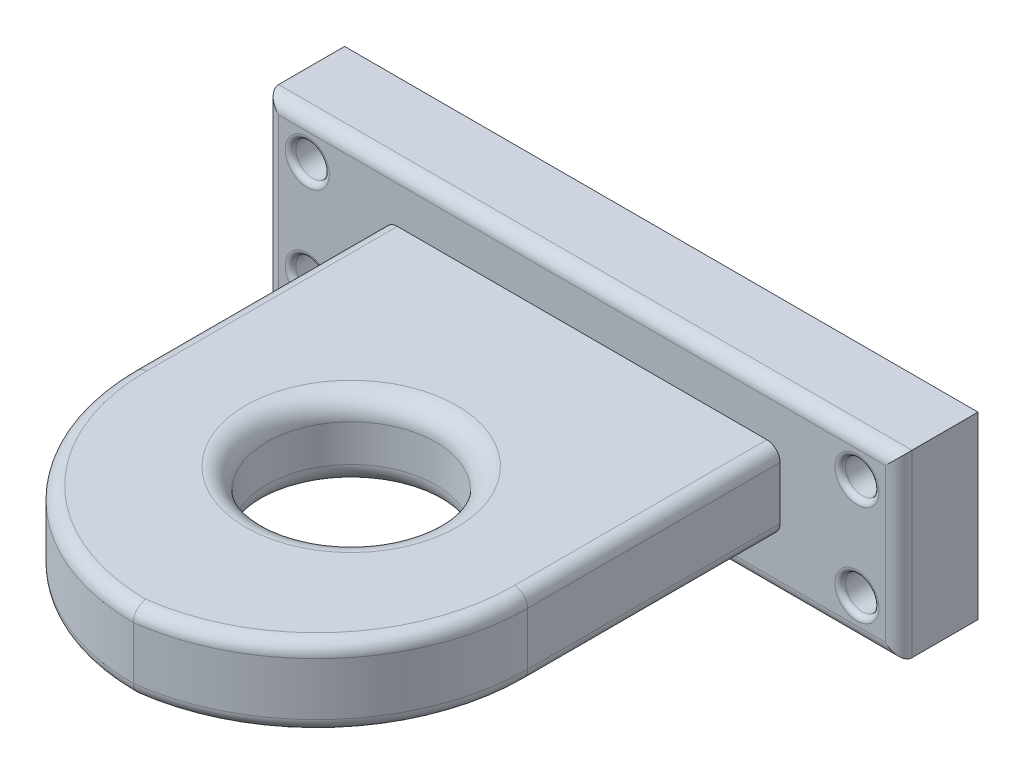
ISO-10303-21;
HEADER;
FILE_DESCRIPTION(('STEP AP214'),'2;1');
FILE_NAME('part.step','',(''),(''),'','','');
FILE_SCHEMA(('AUTOMOTIVE_DESIGN { 1 0 10303 214 1 1 1 1 }'));
ENDSEC;
DATA;
#1=APPLICATION_CONTEXT('core data for automotive mechanical design processes');
#2=APPLICATION_PROTOCOL_DEFINITION('international standard','automotive_design',2000,#1);
#3=PRODUCT_CONTEXT('',#1,'mechanical');
#4=PRODUCT('Part','Part','',(#3));
#5=PRODUCT_RELATED_PRODUCT_CATEGORY('part','',(#4));
#6=PRODUCT_DEFINITION_FORMATION('','',#4);
#7=PRODUCT_DEFINITION_CONTEXT('part definition',#1,'design');
#8=PRODUCT_DEFINITION('design','',#6,#7);
#9=PRODUCT_DEFINITION_SHAPE('','',#8);
#10=(LENGTH_UNIT() NAMED_UNIT(*) SI_UNIT(.MILLI.,.METRE.));
#11=(NAMED_UNIT(*) PLANE_ANGLE_UNIT() SI_UNIT($,.RADIAN.));
#12=(NAMED_UNIT(*) SI_UNIT($,.STERADIAN.) SOLID_ANGLE_UNIT());
#13=UNCERTAINTY_MEASURE_WITH_UNIT(LENGTH_MEASURE(1.E-05),#10,'distance_accuracy_value','');
#14=(GEOMETRIC_REPRESENTATION_CONTEXT(3) GLOBAL_UNCERTAINTY_ASSIGNED_CONTEXT((#13)) GLOBAL_UNIT_ASSIGNED_CONTEXT((#10,
#11,#12)) REPRESENTATION_CONTEXT('',''));
#15=CARTESIAN_POINT('',(0.,0.,0.));
#16=DIRECTION('',(0.,0.,1.));
#17=DIRECTION('',(1.,0.,0.));
#18=AXIS2_PLACEMENT_3D('',#15,#16,#17);
#19=CARTESIAN_POINT('',(0.,30.,0.));
#20=DIRECTION('',(1.,0.,0.));
#21=DIRECTION('',(0.,0.,-1.));
#22=AXIS2_PLACEMENT_3D('',#19,#20,#21);
#23=PLANE('',#22);
#24=DIRECTION('',(0.,-1.,0.));
#25=VECTOR('',#24,1.);
#26=CARTESIAN_POINT('',(0.,30.,0.));
#27=LINE('',#26,#25);
#28=CARTESIAN_POINT('',(0.,25.,0.));
#29=VERTEX_POINT('',#28);
#30=CARTESIAN_POINT('',(0.,5.,0.));
#31=VERTEX_POINT('',#30);
#32=EDGE_CURVE('E197',#29,#31,#27,.T.);
#33=ORIENTED_EDGE('',*,*,#32,.T.);
#34=DIRECTION('',(0.,0.,1.));
#35=VECTOR('',#34,1.);
#36=CARTESIAN_POINT('',(0.,5.,0.));
#37=LINE('',#36,#35);
#38=CARTESIAN_POINT('',(0.,5.,95.));
#39=VERTEX_POINT('',#38);
#40=EDGE_CURVE('E294',#31,#39,#37,.T.);
#41=ORIENTED_EDGE('',*,*,#40,.T.);
#42=DIRECTION('',(0.,-1.,0.));
#43=VECTOR('',#42,1.);
#44=CARTESIAN_POINT('',(0.,30.,95.));
#45=LINE('',#44,#43);
#46=CARTESIAN_POINT('',(0.,25.,95.));
#47=VERTEX_POINT('',#46);
#48=EDGE_CURVE('E210',#39,#47,#45,.F.);
#49=ORIENTED_EDGE('',*,*,#48,.T.);
#50=DIRECTION('',(0.,0.,1.));
#51=VECTOR('',#50,1.);
#52=CARTESIAN_POINT('',(0.,25.,0.));
#53=LINE('',#52,#51);
#54=EDGE_CURVE('E291',#47,#29,#53,.F.);
#55=ORIENTED_EDGE('',*,*,#54,.T.);
#56=EDGE_LOOP('',(#33,#41,#49,#55));
#57=FACE_BOUND('',#56,.T.);
#58=ADVANCED_FACE('F39',(#57),#23,.F.);
#59=CARTESIAN_POINT('',(150.,30.,0.));
#60=DIRECTION('',(-1.,0.,0.));
#61=DIRECTION('',(0.,0.,1.));
#62=AXIS2_PLACEMENT_3D('',#59,#60,#61);
#63=PLANE('',#62);
#64=DIRECTION('',(0.,-1.,0.));
#65=VECTOR('',#64,1.);
#66=CARTESIAN_POINT('',(150.,30.,95.6274606680623));
#67=LINE('',#66,#65);
#68=CARTESIAN_POINT('',(150.,25.,95.6274606680623));
#69=VERTEX_POINT('',#68);
#70=CARTESIAN_POINT('',(150.,5.,95.6274606680623));
#71=VERTEX_POINT('',#70);
#72=EDGE_CURVE('E214',#69,#71,#67,.T.);
#73=ORIENTED_EDGE('',*,*,#72,.T.);
#74=DIRECTION('',(0.,0.,-1.));
#75=VECTOR('',#74,1.);
#76=CARTESIAN_POINT('',(150.,5.,0.));
#77=LINE('',#76,#75);
#78=CARTESIAN_POINT('',(150.,5.,0.));
#79=VERTEX_POINT('',#78);
#80=EDGE_CURVE('E275',#71,#79,#77,.T.);
#81=ORIENTED_EDGE('',*,*,#80,.T.);
#82=DIRECTION('',(0.,-1.,0.));
#83=VECTOR('',#82,1.);
#84=CARTESIAN_POINT('',(150.,30.,0.));
#85=LINE('',#84,#83);
#86=CARTESIAN_POINT('',(150.,25.,0.));
#87=VERTEX_POINT('',#86);
#88=EDGE_CURVE('E202',#87,#79,#85,.T.);
#89=ORIENTED_EDGE('',*,*,#88,.F.);
#90=DIRECTION('',(0.,0.,-1.));
#91=VECTOR('',#90,1.);
#92=CARTESIAN_POINT('',(150.,25.,95.6274606680623));
#93=LINE('',#92,#91);
#94=EDGE_CURVE('E258',#87,#69,#93,.F.);
#95=ORIENTED_EDGE('',*,*,#94,.T.);
#96=EDGE_LOOP('',(#73,#81,#89,#95));
#97=FACE_BOUND('',#96,.T.);
#98=ADVANCED_FACE('F429',(#97),#63,.F.);
#99=CARTESIAN_POINT('',(0.,30.,0.));
#100=DIRECTION('',(0.,1.,0.));
#101=DIRECTION('',(0.,0.,1.));
#102=AXIS2_PLACEMENT_3D('',#99,#100,#101);
#103=PLANE('',#102);
#104=DIRECTION('',(-1.,0.,0.));
#105=VECTOR('',#104,1.);
#106=CARTESIAN_POINT('',(0.,30.,0.));
#107=LINE('',#106,#105);
#108=CARTESIAN_POINT('',(145.,30.,0.));
#109=VERTEX_POINT('',#108);
#110=CARTESIAN_POINT('',(5.,30.,0.));
#111=VERTEX_POINT('',#110);
#112=EDGE_CURVE('E189',#109,#111,#107,.T.);
#113=ORIENTED_EDGE('',*,*,#112,.T.);
#114=DIRECTION('',(0.,0.,1.));
#115=VECTOR('',#114,1.);
#116=CARTESIAN_POINT('',(5.00000000000001,30.,95.));
#117=LINE('',#116,#115);
#118=CARTESIAN_POINT('',(5.00000000000001,30.,95.));
#119=VERTEX_POINT('',#118);
#120=EDGE_CURVE('E317',#111,#119,#117,.T.);
#121=ORIENTED_EDGE('',*,*,#120,.T.);
#122=CARTESIAN_POINT('',(80.,30.,95.));
#123=DIRECTION('',(0.,1.,0.));
#124=DIRECTION('',(0.,0.,1.));
#125=AXIS2_PLACEMENT_3D('',#122,#123,#124);
#126=CIRCLE('',#125,75.);
#127=CARTESIAN_POINT('',(79.6862284823804,30.,169.999343646693));
#128=VERTEX_POINT('',#127);
#129=EDGE_CURVE('E311',#119,#128,#126,.T.);
#130=ORIENTED_EDGE('',*,*,#129,.T.);
#131=CARTESIAN_POINT('',(70.,30.,95.6274606680623));
#132=DIRECTION('',(0.,1.,0.));
#133=DIRECTION('',(0.,0.,1.));
#134=AXIS2_PLACEMENT_3D('',#131,#132,#133);
#135=CIRCLE('',#134,75.);
#136=CARTESIAN_POINT('',(145.,30.,95.6274606680623));
#137=VERTEX_POINT('',#136);
#138=EDGE_CURVE('E63',#128,#137,#135,.T.);
#139=ORIENTED_EDGE('',*,*,#138,.T.);
#140=DIRECTION('',(0.,0.,-1.));
#141=VECTOR('',#140,1.);
#142=CARTESIAN_POINT('',(145.,30.,0.));
#143=LINE('',#142,#141);
#144=EDGE_CURVE('E314',#137,#109,#143,.T.);
#145=ORIENTED_EDGE('',*,*,#144,.T.);
#146=EDGE_LOOP('',(#113,#121,#130,#139,#145));
#147=FACE_BOUND('',#146,.T.);
#148=CARTESIAN_POINT('',(75.,30.,87.5));
#149=DIRECTION('',(0.,1.,0.));
#150=DIRECTION('',(0.,0.,1.));
#151=AXIS2_PLACEMENT_3D('',#148,#149,#150);
#152=CIRCLE('',#151,40.);
#153=CARTESIAN_POINT('',(75.,30.,127.5));
#154=VERTEX_POINT('',#153);
#155=EDGE_CURVE('E222',#154,#154,#152,.F.);
#156=ORIENTED_EDGE('',*,*,#155,.T.);
#157=EDGE_LOOP('',(#156));
#158=FACE_BOUND('',#157,.T.);
#159=ADVANCED_FACE('F435',(#147,#158),#103,.T.);
#160=CARTESIAN_POINT('',(0.,0.,0.));
#161=DIRECTION('',(0.,1.,0.));
#162=DIRECTION('',(0.,0.,1.));
#163=AXIS2_PLACEMENT_3D('',#160,#161,#162);
#164=PLANE('',#163);
#165=DIRECTION('',(-1.,0.,0.));
#166=VECTOR('',#165,1.);
#167=CARTESIAN_POINT('',(0.,0.,0.));
#168=LINE('',#167,#166);
#169=CARTESIAN_POINT('',(145.,0.,0.));
#170=VERTEX_POINT('',#169);
#171=CARTESIAN_POINT('',(5.,0.,0.));
#172=VERTEX_POINT('',#171);
#173=EDGE_CURVE('E184',#170,#172,#168,.T.);
#174=ORIENTED_EDGE('',*,*,#173,.F.);
#175=DIRECTION('',(0.,0.,-1.));
#176=VECTOR('',#175,1.);
#177=CARTESIAN_POINT('',(145.,0.,0.));
#178=LINE('',#177,#176);
#179=CARTESIAN_POINT('',(145.,0.,95.6274606680623));
#180=VERTEX_POINT('',#179);
#181=EDGE_CURVE('E288',#170,#180,#178,.F.);
#182=ORIENTED_EDGE('',*,*,#181,.T.);
#183=CARTESIAN_POINT('',(70.,0.,95.6274606680623));
#184=DIRECTION('',(0.,1.,0.));
#185=DIRECTION('',(0.,0.,1.));
#186=AXIS2_PLACEMENT_3D('',#183,#184,#185);
#187=CIRCLE('',#186,75.);
#188=CARTESIAN_POINT('',(79.6862284823804,0.,169.999343646693));
#189=VERTEX_POINT('',#188);
#190=EDGE_CURVE('E279',#180,#189,#187,.F.);
#191=ORIENTED_EDGE('',*,*,#190,.T.);
#192=CARTESIAN_POINT('',(80.,0.,95.));
#193=DIRECTION('',(0.,1.,0.));
#194=DIRECTION('',(0.,0.,1.));
#195=AXIS2_PLACEMENT_3D('',#192,#193,#194);
#196=CIRCLE('',#195,75.);
#197=CARTESIAN_POINT('',(5.00000000000001,0.,95.));
#198=VERTEX_POINT('',#197);
#199=EDGE_CURVE('E282',#189,#198,#196,.F.);
#200=ORIENTED_EDGE('',*,*,#199,.T.);
#201=DIRECTION('',(0.,0.,1.));
#202=VECTOR('',#201,1.);
#203=CARTESIAN_POINT('',(5.,0.,0.));
#204=LINE('',#203,#202);
#205=EDGE_CURVE('E285',#198,#172,#204,.F.);
#206=ORIENTED_EDGE('',*,*,#205,.T.);
#207=EDGE_LOOP('',(#174,#182,#191,#200,#206));
#208=FACE_BOUND('',#207,.T.);
#209=CARTESIAN_POINT('',(75.,0.,87.5));
#210=DIRECTION('',(0.,1.,0.));
#211=DIRECTION('',(0.,0.,1.));
#212=AXIS2_PLACEMENT_3D('',#209,#210,#211);
#213=CIRCLE('',#212,40.);
#214=CARTESIAN_POINT('',(75.,0.,127.5));
#215=VERTEX_POINT('',#214);
#216=EDGE_CURVE('E226',#215,#215,#213,.T.);
#217=ORIENTED_EDGE('',*,*,#216,.T.);
#218=EDGE_LOOP('',(#217));
#219=FACE_BOUND('',#218,.T.);
#220=ADVANCED_FACE('F491',(#208,#219),#164,.F.);
#221=CARTESIAN_POINT('',(75.,0.,87.5));
#222=DIRECTION('',(0.,1.,0.));
#223=DIRECTION('',(0.,0.,1.));
#224=AXIS2_PLACEMENT_3D('',#221,#222,#223);
#225=CYLINDRICAL_SURFACE('',#224,32.);
#226=CARTESIAN_POINT('',(75.,8.,87.5));
#227=DIRECTION('',(0.,1.,0.));
#228=DIRECTION('',(0.,0.,1.));
#229=AXIS2_PLACEMENT_3D('',#226,#227,#228);
#230=CIRCLE('',#229,32.);
#231=CARTESIAN_POINT('',(75.,8.,119.5));
#232=VERTEX_POINT('',#231);
#233=EDGE_CURVE('E230',#232,#232,#230,.F.);
#234=ORIENTED_EDGE('',*,*,#233,.T.);
#235=EDGE_LOOP('',(#234));
#236=FACE_BOUND('',#235,.T.);
#237=CARTESIAN_POINT('',(75.,22.,87.5));
#238=DIRECTION('',(0.,1.,0.));
#239=DIRECTION('',(0.,0.,1.));
#240=AXIS2_PLACEMENT_3D('',#237,#238,#239);
#241=CIRCLE('',#240,32.);
#242=CARTESIAN_POINT('',(75.,22.,119.5));
#243=VERTEX_POINT('',#242);
#244=EDGE_CURVE('E218',#243,#243,#241,.T.);
#245=ORIENTED_EDGE('',*,*,#244,.T.);
#246=EDGE_LOOP('',(#245));
#247=FACE_BOUND('',#246,.T.);
#248=ADVANCED_FACE('F444',(#236,#247),#225,.F.);
#249=CARTESIAN_POINT('',(80.,30.,95.));
#250=DIRECTION('',(0.,-1.,0.));
#251=DIRECTION('',(0.,0.,-1.));
#252=AXIS2_PLACEMENT_3D('',#249,#250,#251);
#253=CYLINDRICAL_SURFACE('',#252,80.);
#254=ORIENTED_EDGE('',*,*,#48,.F.);
#255=CARTESIAN_POINT('',(80.,5.,95.));
#256=DIRECTION('',(0.,1.,0.));
#257=DIRECTION('',(0.,0.,1.));
#258=AXIS2_PLACEMENT_3D('',#255,#256,#257);
#259=CIRCLE('',#258,80.);
#260=CARTESIAN_POINT('',(80.,5.,175.));
#261=VERTEX_POINT('',#260);
#262=EDGE_CURVE('E300',#39,#261,#259,.T.);
#263=ORIENTED_EDGE('',*,*,#262,.T.);
#264=DIRECTION('',(0.,-1.,0.));
#265=VECTOR('',#264,1.);
#266=CARTESIAN_POINT('',(80.,30.,175.));
#267=LINE('',#266,#265);
#268=CARTESIAN_POINT('',(80.,25.,175.));
#269=VERTEX_POINT('',#268);
#270=EDGE_CURVE('E206',#269,#261,#267,.T.);
#271=ORIENTED_EDGE('',*,*,#270,.F.);
#272=CARTESIAN_POINT('',(80.,25.,95.));
#273=DIRECTION('',(0.,1.,0.));
#274=DIRECTION('',(0.,0.,1.));
#275=AXIS2_PLACEMENT_3D('',#272,#273,#274);
#276=CIRCLE('',#275,80.);
#277=EDGE_CURVE('E297',#269,#47,#276,.F.);
#278=ORIENTED_EDGE('',*,*,#277,.T.);
#279=EDGE_LOOP('',(#254,#263,#271,#278));
#280=FACE_BOUND('',#279,.T.);
#281=ADVANCED_FACE('F440',(#280),#253,.T.);
#282=CARTESIAN_POINT('',(70.,30.,95.6274606680623));
#283=DIRECTION('',(0.,-1.,0.));
#284=DIRECTION('',(0.,0.,-1.));
#285=AXIS2_PLACEMENT_3D('',#282,#283,#284);
#286=CYLINDRICAL_SURFACE('',#285,80.);
#287=ORIENTED_EDGE('',*,*,#270,.T.);
#288=CARTESIAN_POINT('',(70.,5.,95.6274606680623));
#289=DIRECTION('',(0.,1.,0.));
#290=DIRECTION('',(0.,0.,1.));
#291=AXIS2_PLACEMENT_3D('',#288,#289,#290);
#292=CIRCLE('',#291,80.);
#293=EDGE_CURVE('E306',#261,#71,#292,.T.);
#294=ORIENTED_EDGE('',*,*,#293,.T.);
#295=ORIENTED_EDGE('',*,*,#72,.F.);
#296=CARTESIAN_POINT('',(70.,25.,95.6274606680623));
#297=DIRECTION('',(0.,1.,0.));
#298=DIRECTION('',(0.,0.,1.));
#299=AXIS2_PLACEMENT_3D('',#296,#297,#298);
#300=CIRCLE('',#299,80.);
#301=EDGE_CURVE('E303',#69,#269,#300,.F.);
#302=ORIENTED_EDGE('',*,*,#301,.T.);
#303=EDGE_LOOP('',(#287,#294,#295,#302));
#304=FACE_BOUND('',#303,.T.);
#305=ADVANCED_FACE('F443',(#304),#286,.T.);
#306=CARTESIAN_POINT('',(75.,22.,87.5));
#307=DIRECTION('',(0.,1.,0.));
#308=DIRECTION('',(0.,0.,1.));
#309=AXIS2_PLACEMENT_3D('',#306,#307,#308);
#310=TOROIDAL_SURFACE('',#309,40.,8.);
#311=ORIENTED_EDGE('',*,*,#155,.F.);
#312=EDGE_LOOP('',(#311));
#313=FACE_BOUND('',#312,.T.);
#314=ORIENTED_EDGE('',*,*,#244,.F.);
#315=EDGE_LOOP('',(#314));
#316=FACE_BOUND('',#315,.T.);
#317=ADVANCED_FACE('F448',(#313,#316),#310,.T.);
#318=CARTESIAN_POINT('',(75.,8.,87.5));
#319=DIRECTION('',(0.,1.,0.));
#320=DIRECTION('',(0.,0.,1.));
#321=AXIS2_PLACEMENT_3D('',#318,#319,#320);
#322=TOROIDAL_SURFACE('',#321,40.,8.);
#323=ORIENTED_EDGE('',*,*,#233,.F.);
#324=EDGE_LOOP('',(#323));
#325=FACE_BOUND('',#324,.T.);
#326=ORIENTED_EDGE('',*,*,#216,.F.);
#327=EDGE_LOOP('',(#326));
#328=FACE_BOUND('',#327,.T.);
#329=ADVANCED_FACE('F452',(#325,#328),#322,.T.);
#330=CARTESIAN_POINT('',(0.,0.,0.));
#331=DIRECTION('',(0.,0.,-1.));
#332=DIRECTION('',(-1.,0.,0.));
#333=AXIS2_PLACEMENT_3D('',#330,#331,#332);
#334=PLANE('',#333);
#335=CARTESIAN_POINT('',(-29.14,-4.04999999999996,0.));
#336=DIRECTION('',(0.,0.,-1.));
#337=DIRECTION('',(-1.,0.,0.));
#338=AXIS2_PLACEMENT_3D('',#335,#336,#337);
#339=CIRCLE('',#338,8.35);
#340=CARTESIAN_POINT('',(-37.49,-4.04999999999996,0.));
#341=VERTEX_POINT('',#340);
#342=EDGE_CURVE('E402',#341,#341,#339,.T.);
#343=ORIENTED_EDGE('',*,*,#342,.T.);
#344=EDGE_LOOP('',(#343));
#345=FACE_BOUND('',#344,.T.);
#346=CARTESIAN_POINT('',(-29.14,34.05,0.));
#347=DIRECTION('',(0.,0.,-1.));
#348=DIRECTION('',(-1.,0.,0.));
#349=AXIS2_PLACEMENT_3D('',#346,#347,#348);
#350=CIRCLE('',#349,8.35);
#351=CARTESIAN_POINT('',(-37.49,34.05,0.));
#352=VERTEX_POINT('',#351);
#353=EDGE_CURVE('E398',#352,#352,#350,.T.);
#354=ORIENTED_EDGE('',*,*,#353,.T.);
#355=EDGE_LOOP('',(#354));
#356=FACE_BOUND('',#355,.T.);
#357=CARTESIAN_POINT('',(179.14,34.05,0.));
#358=DIRECTION('',(0.,0.,-1.));
#359=DIRECTION('',(-1.,0.,0.));
#360=AXIS2_PLACEMENT_3D('',#357,#358,#359);
#361=CIRCLE('',#360,8.35);
#362=CARTESIAN_POINT('',(170.79,34.05,0.));
#363=VERTEX_POINT('',#362);
#364=EDGE_CURVE('E394',#363,#363,#361,.T.);
#365=ORIENTED_EDGE('',*,*,#364,.T.);
#366=EDGE_LOOP('',(#365));
#367=FACE_BOUND('',#366,.T.);
#368=CARTESIAN_POINT('',(179.14,-4.04999999999996,0.));
#369=DIRECTION('',(0.,0.,-1.));
#370=DIRECTION('',(-1.,0.,0.));
#371=AXIS2_PLACEMENT_3D('',#368,#369,#370);
#372=CIRCLE('',#371,8.35);
#373=CARTESIAN_POINT('',(170.79,-4.04999999999996,0.));
#374=VERTEX_POINT('',#373);
#375=EDGE_CURVE('E390',#374,#374,#372,.T.);
#376=ORIENTED_EDGE('',*,*,#375,.T.);
#377=EDGE_LOOP('',(#376));
#378=FACE_BOUND('',#377,.T.);
#379=DIRECTION('',(0.,1.,0.));
#380=VECTOR('',#379,1.);
#381=CARTESIAN_POINT('',(-40.,0.,0.));
#382=LINE('',#381,#380);
#383=CARTESIAN_POINT('',(-40.,44.05,0.));
#384=VERTEX_POINT('',#383);
#385=CARTESIAN_POINT('',(-40.,-14.05,0.));
#386=VERTEX_POINT('',#385);
#387=EDGE_CURVE('E243',#384,#386,#382,.F.);
#388=ORIENTED_EDGE('',*,*,#387,.T.);
#389=DIRECTION('',(-1.,0.,0.));
#390=VECTOR('',#389,1.);
#391=CARTESIAN_POINT('',(0.,-14.05,0.));
#392=LINE('',#391,#390);
#393=CARTESIAN_POINT('',(190.,-14.05,0.));
#394=VERTEX_POINT('',#393);
#395=EDGE_CURVE('E246',#386,#394,#392,.F.);
#396=ORIENTED_EDGE('',*,*,#395,.T.);
#397=DIRECTION('',(0.,-1.,0.));
#398=VECTOR('',#397,1.);
#399=CARTESIAN_POINT('',(190.,0.,0.));
#400=LINE('',#399,#398);
#401=CARTESIAN_POINT('',(190.,44.05,0.));
#402=VERTEX_POINT('',#401);
#403=EDGE_CURVE('E237',#394,#402,#400,.F.);
#404=ORIENTED_EDGE('',*,*,#403,.T.);
#405=DIRECTION('',(1.,0.,0.));
#406=VECTOR('',#405,1.);
#407=CARTESIAN_POINT('',(0.,44.05,0.));
#408=LINE('',#407,#406);
#409=EDGE_CURVE('E240',#402,#384,#408,.F.);
#410=ORIENTED_EDGE('',*,*,#409,.T.);
#411=EDGE_LOOP('',(#388,#396,#404,#410));
#412=FACE_BOUND('',#411,.T.);
#413=ORIENTED_EDGE('',*,*,#112,.F.);
#414=CARTESIAN_POINT('',(145.,25.,0.));
#415=DIRECTION('',(0.,0.,-1.));
#416=DIRECTION('',(-1.,0.,0.));
#417=AXIS2_PLACEMENT_3D('',#414,#415,#416);
#418=CIRCLE('',#417,5.);
#419=EDGE_CURVE('E330',#109,#87,#418,.T.);
#420=ORIENTED_EDGE('',*,*,#419,.T.);
#421=ORIENTED_EDGE('',*,*,#88,.T.);
#422=CARTESIAN_POINT('',(145.,5.,0.));
#423=DIRECTION('',(0.,0.,-1.));
#424=DIRECTION('',(-1.,0.,0.));
#425=AXIS2_PLACEMENT_3D('',#422,#423,#424);
#426=CIRCLE('',#425,5.);
#427=EDGE_CURVE('E321',#79,#170,#426,.T.);
#428=ORIENTED_EDGE('',*,*,#427,.T.);
#429=ORIENTED_EDGE('',*,*,#173,.T.);
#430=CARTESIAN_POINT('',(5.,5.,0.));
#431=DIRECTION('',(0.,0.,-1.));
#432=DIRECTION('',(-1.,0.,0.));
#433=AXIS2_PLACEMENT_3D('',#430,#431,#432);
#434=CIRCLE('',#433,5.);
#435=EDGE_CURVE('E324',#172,#31,#434,.T.);
#436=ORIENTED_EDGE('',*,*,#435,.T.);
#437=ORIENTED_EDGE('',*,*,#32,.F.);
#438=CARTESIAN_POINT('',(5.,25.,0.));
#439=DIRECTION('',(0.,0.,-1.));
#440=DIRECTION('',(-1.,0.,0.));
#441=AXIS2_PLACEMENT_3D('',#438,#439,#440);
#442=CIRCLE('',#441,5.);
#443=EDGE_CURVE('E327',#29,#111,#442,.T.);
#444=ORIENTED_EDGE('',*,*,#443,.T.);
#445=EDGE_LOOP('',(#413,#420,#421,#428,#429,#436,#437,#444));
#446=FACE_BOUND('',#445,.T.);
#447=ADVANCED_FACE('F456',(#345,#356,#367,#378,#412,#446),#334,.F.);
#448=CARTESIAN_POINT('',(195.,49.05,-30.));
#449=DIRECTION('',(-1.,0.,0.));
#450=DIRECTION('',(0.,0.,1.));
#451=AXIS2_PLACEMENT_3D('',#448,#449,#450);
#452=PLANE('',#451);
#453=DIRECTION('',(0.,0.,1.));
#454=VECTOR('',#453,1.);
#455=CARTESIAN_POINT('',(195.,49.05,-30.));
#456=LINE('',#455,#454);
#457=CARTESIAN_POINT('',(195.,49.05,-30.));
#458=VERTEX_POINT('',#457);
#459=CARTESIAN_POINT('',(195.,49.05,-5.));
#460=VERTEX_POINT('',#459);
#461=EDGE_CURVE('E523',#458,#460,#456,.T.);
#462=ORIENTED_EDGE('',*,*,#461,.T.);
#463=DIRECTION('',(0.,-1.,0.));
#464=VECTOR('',#463,1.);
#465=CARTESIAN_POINT('',(195.,49.05,-5.));
#466=LINE('',#465,#464);
#467=CARTESIAN_POINT('',(195.,-19.05,-5.));
#468=VERTEX_POINT('',#467);
#469=EDGE_CURVE('E182',#460,#468,#466,.T.);
#470=ORIENTED_EDGE('',*,*,#469,.T.);
#471=DIRECTION('',(0.,0.,1.));
#472=VECTOR('',#471,1.);
#473=CARTESIAN_POINT('',(195.,-19.05,-30.));
#474=LINE('',#473,#472);
#475=CARTESIAN_POINT('',(195.,-19.05,-30.));
#476=VERTEX_POINT('',#475);
#477=EDGE_CURVE('E160',#476,#468,#474,.T.);
#478=ORIENTED_EDGE('',*,*,#477,.F.);
#479=DIRECTION('',(0.,-1.,0.));
#480=VECTOR('',#479,1.);
#481=CARTESIAN_POINT('',(195.,49.05,-30.));
#482=LINE('',#481,#480);
#483=EDGE_CURVE('E168',#458,#476,#482,.T.);
#484=ORIENTED_EDGE('',*,*,#483,.F.);
#485=EDGE_LOOP('',(#462,#470,#478,#484));
#486=FACE_BOUND('',#485,.T.);
#487=ADVANCED_FACE('F180',(#486),#452,.F.);
#488=CARTESIAN_POINT('',(195.,-19.05,-30.));
#489=DIRECTION('',(0.,1.,0.));
#490=DIRECTION('',(0.,0.,1.));
#491=AXIS2_PLACEMENT_3D('',#488,#489,#490);
#492=PLANE('',#491);
#493=ORIENTED_EDGE('',*,*,#477,.T.);
#494=DIRECTION('',(-1.,0.,0.));
#495=VECTOR('',#494,1.);
#496=CARTESIAN_POINT('',(195.,-19.05,-5.));
#497=LINE('',#496,#495);
#498=CARTESIAN_POINT('',(-45.,-19.05,-5.));
#499=VERTEX_POINT('',#498);
#500=EDGE_CURVE('E234',#468,#499,#497,.T.);
#501=ORIENTED_EDGE('',*,*,#500,.T.);
#502=DIRECTION('',(0.,0.,1.));
#503=VECTOR('',#502,1.);
#504=CARTESIAN_POINT('',(-45.,-19.05,-30.));
#505=LINE('',#504,#503);
#506=CARTESIAN_POINT('',(-45.,-19.05,-30.));
#507=VERTEX_POINT('',#506);
#508=EDGE_CURVE('E163',#507,#499,#505,.T.);
#509=ORIENTED_EDGE('',*,*,#508,.F.);
#510=DIRECTION('',(-1.,0.,0.));
#511=VECTOR('',#510,1.);
#512=CARTESIAN_POINT('',(195.,-19.05,-30.));
#513=LINE('',#512,#511);
#514=EDGE_CURVE('E155',#476,#507,#513,.T.);
#515=ORIENTED_EDGE('',*,*,#514,.F.);
#516=EDGE_LOOP('',(#493,#501,#509,#515));
#517=FACE_BOUND('',#516,.T.);
#518=ADVANCED_FACE('F157',(#517),#492,.F.);
#519=CARTESIAN_POINT('',(-45.,49.05,-30.));
#520=DIRECTION('',(1.,0.,0.));
#521=DIRECTION('',(0.,1.,0.));
#522=AXIS2_PLACEMENT_3D('',#519,#520,#521);
#523=PLANE('',#522);
#524=ORIENTED_EDGE('',*,*,#508,.T.);
#525=DIRECTION('',(0.,1.,0.));
#526=VECTOR('',#525,1.);
#527=CARTESIAN_POINT('',(-45.,49.05,-5.));
#528=LINE('',#527,#526);
#529=CARTESIAN_POINT('',(-45.,49.05,-5.));
#530=VERTEX_POINT('',#529);
#531=EDGE_CURVE('E250',#499,#530,#528,.T.);
#532=ORIENTED_EDGE('',*,*,#531,.T.);
#533=DIRECTION('',(0.,0.,1.));
#534=VECTOR('',#533,1.);
#535=CARTESIAN_POINT('',(-45.,49.05,-30.));
#536=LINE('',#535,#534);
#537=CARTESIAN_POINT('',(-45.,49.05,-30.));
#538=VERTEX_POINT('',#537);
#539=EDGE_CURVE('E191',#538,#530,#536,.T.);
#540=ORIENTED_EDGE('',*,*,#539,.F.);
#541=DIRECTION('',(0.,1.,0.));
#542=VECTOR('',#541,1.);
#543=CARTESIAN_POINT('',(-45.,49.05,-30.));
#544=LINE('',#543,#542);
#545=EDGE_CURVE('E167',#507,#538,#544,.T.);
#546=ORIENTED_EDGE('',*,*,#545,.F.);
#547=EDGE_LOOP('',(#524,#532,#540,#546));
#548=FACE_BOUND('',#547,.T.);
#549=ADVANCED_FACE('F543',(#548),#523,.F.);
#550=CARTESIAN_POINT('',(195.,49.05,-30.));
#551=DIRECTION('',(0.,-1.,0.));
#552=DIRECTION('',(0.,0.,-1.));
#553=AXIS2_PLACEMENT_3D('',#550,#551,#552);
#554=PLANE('',#553);
#555=ORIENTED_EDGE('',*,*,#539,.T.);
#556=DIRECTION('',(1.,0.,0.));
#557=VECTOR('',#556,1.);
#558=CARTESIAN_POINT('',(195.,49.05,-5.));
#559=LINE('',#558,#557);
#560=EDGE_CURVE('E253',#530,#460,#559,.T.);
#561=ORIENTED_EDGE('',*,*,#560,.T.);
#562=ORIENTED_EDGE('',*,*,#461,.F.);
#563=DIRECTION('',(1.,0.,0.));
#564=VECTOR('',#563,1.);
#565=CARTESIAN_POINT('',(195.,49.05,-30.));
#566=LINE('',#565,#564);
#567=EDGE_CURVE('E173',#538,#458,#566,.T.);
#568=ORIENTED_EDGE('',*,*,#567,.F.);
#569=EDGE_LOOP('',(#555,#561,#562,#568));
#570=FACE_BOUND('',#569,.T.);
#571=ADVANCED_FACE('F530',(#570),#554,.F.);
#572=CARTESIAN_POINT('',(0.,0.,-30.));
#573=DIRECTION('',(0.,0.,-1.));
#574=DIRECTION('',(-1.,0.,0.));
#575=AXIS2_PLACEMENT_3D('',#572,#573,#574);
#576=PLANE('',#575);
#577=CARTESIAN_POINT('',(179.14,-4.04999999999996,-30.));
#578=DIRECTION('',(0.,0.,1.));
#579=DIRECTION('',(-1.,0.,0.));
#580=AXIS2_PLACEMENT_3D('',#577,#578,#579);
#581=CIRCLE('',#580,6.35);
#582=CARTESIAN_POINT('',(172.79,-4.04999999999996,-30.));
#583=VERTEX_POINT('',#582);
#584=EDGE_CURVE('E504',#583,#583,#581,.T.);
#585=ORIENTED_EDGE('',*,*,#584,.T.);
#586=EDGE_LOOP('',(#585));
#587=FACE_BOUND('',#586,.T.);
#588=CARTESIAN_POINT('',(-29.14,34.05,-30.));
#589=DIRECTION('',(0.,0.,1.));
#590=DIRECTION('',(-1.,0.,0.));
#591=AXIS2_PLACEMENT_3D('',#588,#589,#590);
#592=CIRCLE('',#591,6.35);
#593=CARTESIAN_POINT('',(-35.49,34.05,-30.));
#594=VERTEX_POINT('',#593);
#595=EDGE_CURVE('E508',#594,#594,#592,.T.);
#596=ORIENTED_EDGE('',*,*,#595,.T.);
#597=EDGE_LOOP('',(#596));
#598=FACE_BOUND('',#597,.T.);
#599=CARTESIAN_POINT('',(-29.14,-4.04999999999996,-30.));
#600=DIRECTION('',(0.,0.,1.));
#601=DIRECTION('',(1.,0.,0.));
#602=AXIS2_PLACEMENT_3D('',#599,#600,#601);
#603=CIRCLE('',#602,6.35);
#604=CARTESIAN_POINT('',(-22.79,-4.04999999999996,-30.));
#605=VERTEX_POINT('',#604);
#606=EDGE_CURVE('E512',#605,#605,#603,.T.);
#607=ORIENTED_EDGE('',*,*,#606,.T.);
#608=EDGE_LOOP('',(#607));
#609=FACE_BOUND('',#608,.T.);
#610=CARTESIAN_POINT('',(179.14,34.05,-30.));
#611=DIRECTION('',(0.,0.,1.));
#612=DIRECTION('',(1.,0.,0.));
#613=AXIS2_PLACEMENT_3D('',#610,#611,#612);
#614=CIRCLE('',#613,6.35);
#615=CARTESIAN_POINT('',(185.49,34.05,-30.));
#616=VERTEX_POINT('',#615);
#617=EDGE_CURVE('E501',#616,#616,#614,.T.);
#618=ORIENTED_EDGE('',*,*,#617,.T.);
#619=EDGE_LOOP('',(#618));
#620=FACE_BOUND('',#619,.T.);
#621=ORIENTED_EDGE('',*,*,#483,.T.);
#622=ORIENTED_EDGE('',*,*,#514,.T.);
#623=ORIENTED_EDGE('',*,*,#545,.T.);
#624=ORIENTED_EDGE('',*,*,#567,.T.);
#625=EDGE_LOOP('',(#621,#622,#623,#624));
#626=FACE_BOUND('',#625,.T.);
#627=ADVANCED_FACE('F171',(#587,#598,#609,#620,#626),#576,.T.);
#628=CARTESIAN_POINT('',(195.,44.05,-5.));
#629=DIRECTION('',(1.,0.,0.));
#630=DIRECTION('',(0.,0.,-1.));
#631=AXIS2_PLACEMENT_3D('',#628,#629,#630);
#632=CYLINDRICAL_SURFACE('',#631,5.);
#633=CARTESIAN_POINT('',(-40.,44.05,-5.));
#634=DIRECTION('',(0.707106781186547,0.707106781186548,0.));
#635=DIRECTION('',(0.707106781186548,-0.707106781186547,0.));
#636=AXIS2_PLACEMENT_3D('',#633,#634,#635);
#637=ELLIPSE('',#636,7.07106781186548,5.);
#638=EDGE_CURVE('E266',#384,#530,#637,.F.);
#639=ORIENTED_EDGE('',*,*,#638,.F.);
#640=ORIENTED_EDGE('',*,*,#409,.F.);
#641=CARTESIAN_POINT('',(190.,44.05,-5.));
#642=DIRECTION('',(0.707106781186547,-0.707106781186547,0.));
#643=DIRECTION('',(-0.707106781186547,-0.707106781186547,0.));
#644=AXIS2_PLACEMENT_3D('',#641,#642,#643);
#645=ELLIPSE('',#644,7.07106781186547,5.);
#646=EDGE_CURVE('E178',#460,#402,#645,.T.);
#647=ORIENTED_EDGE('',*,*,#646,.F.);
#648=ORIENTED_EDGE('',*,*,#560,.F.);
#649=EDGE_LOOP('',(#639,#640,#647,#648));
#650=FACE_BOUND('',#649,.T.);
#651=ADVANCED_FACE('F468',(#650),#632,.T.);
#652=CARTESIAN_POINT('',(190.,49.05,-5.));
#653=DIRECTION('',(0.,-1.,0.));
#654=DIRECTION('',(0.,0.,-1.));
#655=AXIS2_PLACEMENT_3D('',#652,#653,#654);
#656=CYLINDRICAL_SURFACE('',#655,5.);
#657=ORIENTED_EDGE('',*,*,#646,.T.);
#658=ORIENTED_EDGE('',*,*,#403,.F.);
#659=CARTESIAN_POINT('',(190.,-14.05,-5.));
#660=DIRECTION('',(-0.707106781186547,-0.707106781186547,0.));
#661=DIRECTION('',(0.707106781186547,-0.707106781186547,0.));
#662=AXIS2_PLACEMENT_3D('',#659,#660,#661);
#663=ELLIPSE('',#662,7.07106781186547,5.);
#664=EDGE_CURVE('E262',#468,#394,#663,.T.);
#665=ORIENTED_EDGE('',*,*,#664,.F.);
#666=ORIENTED_EDGE('',*,*,#469,.F.);
#667=EDGE_LOOP('',(#657,#658,#665,#666));
#668=FACE_BOUND('',#667,.T.);
#669=ADVANCED_FACE('F464',(#668),#656,.T.);
#670=CARTESIAN_POINT('',(-40.,49.05,-5.));
#671=DIRECTION('',(0.,1.,0.));
#672=DIRECTION('',(-1.,0.,0.));
#673=AXIS2_PLACEMENT_3D('',#670,#671,#672);
#674=CYLINDRICAL_SURFACE('',#673,5.);
#675=ORIENTED_EDGE('',*,*,#638,.T.);
#676=ORIENTED_EDGE('',*,*,#531,.F.);
#677=CARTESIAN_POINT('',(-40.,-14.05,-5.));
#678=DIRECTION('',(-0.707106781186548,0.707106781186547,0.));
#679=DIRECTION('',(0.707106781186547,0.707106781186548,0.));
#680=AXIS2_PLACEMENT_3D('',#677,#678,#679);
#681=ELLIPSE('',#680,7.07106781186547,5.);
#682=EDGE_CURVE('E259',#386,#499,#681,.F.);
#683=ORIENTED_EDGE('',*,*,#682,.F.);
#684=ORIENTED_EDGE('',*,*,#387,.F.);
#685=EDGE_LOOP('',(#675,#676,#683,#684));
#686=FACE_BOUND('',#685,.T.);
#687=ADVANCED_FACE('F460',(#686),#674,.T.);
#688=CARTESIAN_POINT('',(195.,-14.05,-5.));
#689=DIRECTION('',(-1.,0.,0.));
#690=DIRECTION('',(0.,0.,1.));
#691=AXIS2_PLACEMENT_3D('',#688,#689,#690);
#692=CYLINDRICAL_SURFACE('',#691,5.);
#693=ORIENTED_EDGE('',*,*,#664,.T.);
#694=ORIENTED_EDGE('',*,*,#395,.F.);
#695=ORIENTED_EDGE('',*,*,#682,.T.);
#696=ORIENTED_EDGE('',*,*,#500,.F.);
#697=EDGE_LOOP('',(#693,#694,#695,#696));
#698=FACE_BOUND('',#697,.T.);
#699=ADVANCED_FACE('F361',(#698),#692,.T.);
#700=CARTESIAN_POINT('',(5.,5.,0.));
#701=DIRECTION('',(0.,0.,1.));
#702=DIRECTION('',(1.,0.,0.));
#703=AXIS2_PLACEMENT_3D('',#700,#701,#702);
#704=CYLINDRICAL_SURFACE('',#703,5.);
#705=ORIENTED_EDGE('',*,*,#435,.F.);
#706=ORIENTED_EDGE('',*,*,#205,.F.);
#707=CARTESIAN_POINT('',(5.00000000000001,5.,95.));
#708=DIRECTION('',(0.,0.,1.));
#709=DIRECTION('',(1.,0.,0.));
#710=AXIS2_PLACEMENT_3D('',#707,#708,#709);
#711=CIRCLE('',#710,5.);
#712=EDGE_CURVE('E263',#39,#198,#711,.T.);
#713=ORIENTED_EDGE('',*,*,#712,.F.);
#714=ORIENTED_EDGE('',*,*,#40,.F.);
#715=EDGE_LOOP('',(#705,#706,#713,#714));
#716=FACE_BOUND('',#715,.T.);
#717=ADVANCED_FACE('F357',(#716),#704,.T.);
#718=CARTESIAN_POINT('',(80.,5.,95.));
#719=DIRECTION('',(0.,1.,0.));
#720=DIRECTION('',(0.,0.,1.));
#721=AXIS2_PLACEMENT_3D('',#718,#719,#720);
#722=TOROIDAL_SURFACE('',#721,75.,5.);
#723=ORIENTED_EDGE('',*,*,#712,.T.);
#724=ORIENTED_EDGE('',*,*,#199,.F.);
#725=CARTESIAN_POINT('',(80.,5.,175.));
#726=CARTESIAN_POINT('',(80.000000956948,4.85957866579256,175.000015251122));
#727=CARTESIAN_POINT('',(79.9996288693481,4.71915960098075,174.994085196557));
#728=CARTESIAN_POINT('',(79.9981455202449,4.43932751693349,174.97044468523));
#729=CARTESIAN_POINT('',(79.9970342968402,4.29991444621877,174.952734835653));
#730=CARTESIAN_POINT('',(79.9940806889875,4.02318414411195,174.905662437285));
#731=CARTESIAN_POINT('',(79.9922388490578,3.88586543079313,174.876308566621));
#732=CARTESIAN_POINT('',(79.9878375544206,3.61419444779103,174.806164016353));
#733=CARTESIAN_POINT('',(79.9852781079518,3.47984214407014,174.76537346805));
#734=CARTESIAN_POINT('',(79.9794590690107,3.21501912145998,174.672633966799));
#735=CARTESIAN_POINT('',(79.9761992816363,3.08454949463561,174.620681907647));
#736=CARTESIAN_POINT('',(79.9690020590361,2.82840906506267,174.505977943454));
#737=CARTESIAN_POINT('',(79.9650643746958,2.7027400472661,174.443222068213));
#738=CARTESIAN_POINT('',(79.9565428685451,2.45721314526556,174.307412660794));
#739=CARTESIAN_POINT('',(79.951959420201,2.33735195567648,174.234365080643));
#740=CARTESIAN_POINT('',(79.9421757448892,2.10416979022499,174.078440162801));
#741=CARTESIAN_POINT('',(79.9369753038244,1.99085110501657,173.995559412988));
#742=CARTESIAN_POINT('',(79.9259926608604,1.77153115897507,173.820526243214));
#743=CARTESIAN_POINT('',(79.9202101007474,1.66553447229858,173.728368114308));
#744=CARTESIAN_POINT('',(79.9081071760366,1.46168308213854,173.535480729855));
#745=CARTESIAN_POINT('',(79.9017868103734,1.36382839478427,173.434751457331));
#746=CARTESIAN_POINT('',(79.8886501233687,1.17690451754072,173.225388740697));
#747=CARTESIAN_POINT('',(79.881833562859,1.08783961374732,173.116751484902));
#748=CARTESIAN_POINT('',(79.8677581560516,0.919204437527928,172.892428152401));
#749=CARTESIAN_POINT('',(79.8604994627196,0.839630909219858,172.776744513547));
#750=CARTESIAN_POINT('',(79.8455707956644,0.69031655395423,172.538822555804));
#751=CARTESIAN_POINT('',(79.8378998524355,0.62060044280087,172.416568785656));
#752=CARTESIAN_POINT('',(79.8222206531958,0.491747680828527,172.166685405902));
#753=CARTESIAN_POINT('',(79.8142125202045,0.432607212236006,172.039057756889));
#754=CARTESIAN_POINT('',(79.7979166458623,0.325312078776555,171.779346269434));
#755=CARTESIAN_POINT('',(79.7896290284928,0.277152614365732,171.647264406916));
#756=CARTESIAN_POINT('',(79.7728325904221,0.192136272913032,171.379575308211));
#757=CARTESIAN_POINT('',(79.7643238338436,0.155276158254706,171.243969093964));
#758=CARTESIAN_POINT('',(79.7447274121033,0.0843569920658041,170.931655944506));
#759=CARTESIAN_POINT('',(79.7335867287552,0.0539933641186877,170.754104044996));
#760=CARTESIAN_POINT('',(79.7111808183206,0.0125995953384585,170.397015360798));
#761=CARTESIAN_POINT('',(79.6999158279673,0.00153752897717529,170.21748234899));
#762=CARTESIAN_POINT('',(79.6878455918976,4.97032002353235E-05,170.025115931705));
#763=CARTESIAN_POINT('',(79.687037014688,-9.50066019714742E-08,170.012229431392));
#764=CARTESIAN_POINT('',(79.6862284823805,0.,169.999343646693));
#765=B_SPLINE_CURVE_WITH_KNOTS('',3,(#725,#726,#727,#728,#729,#730,#731,#732,#733,#734,#735,
#736,#737,#738,#739,#740,#741,#742,#743,#744,#745,#746,#747,#748,#749,#750,#751,#752,#753,#754,
#755,#756,#757,#758,#759,#760,#761,#762,#763,#764),.UNSPECIFIED.,.F.,.F.,(4,2,2,2,2,2,2,2,2,2,2,
2,2,2,2,2,2,2,2,4),(0.,0.421135130931425,0.842248556269158,1.26304871950759,1.68384405182726,
2.10475664189286,2.52582424095679,2.94664931503158,3.36762084537687,3.78885302774953,
4.21008604456242,4.63152345955631,5.05281588808548,5.47514658361313,5.89732450995533,
6.31931755682242,6.74118957624417,7.28156839977652,7.82105256555536,7.85978794097077),.UNSPECIFIED.);
#766=EDGE_CURVE('E338',#261,#189,#765,.T.);
#767=ORIENTED_EDGE('',*,*,#766,.F.);
#768=ORIENTED_EDGE('',*,*,#262,.F.);
#769=EDGE_LOOP('',(#723,#724,#767,#768));
#770=FACE_BOUND('',#769,.T.);
#771=ADVANCED_FACE('F353',(#770),#722,.T.);
#772=CARTESIAN_POINT('',(70.,5.,95.6274606680623));
#773=DIRECTION('',(0.,1.,0.));
#774=DIRECTION('',(0.,0.,1.));
#775=AXIS2_PLACEMENT_3D('',#772,#773,#774);
#776=TOROIDAL_SURFACE('',#775,75.,5.);
#777=ORIENTED_EDGE('',*,*,#766,.T.);
#778=ORIENTED_EDGE('',*,*,#190,.F.);
#779=CARTESIAN_POINT('',(145.,5.,95.6274606680623));
#780=DIRECTION('',(0.,0.,-1.));
#781=DIRECTION('',(-1.,0.,0.));
#782=AXIS2_PLACEMENT_3D('',#779,#780,#781);
#783=CIRCLE('',#782,5.);
#784=EDGE_CURVE('E334',#71,#180,#783,.T.);
#785=ORIENTED_EDGE('',*,*,#784,.F.);
#786=ORIENTED_EDGE('',*,*,#293,.F.);
#787=EDGE_LOOP('',(#777,#778,#785,#786));
#788=FACE_BOUND('',#787,.T.);
#789=ADVANCED_FACE('F350',(#788),#776,.T.);
#790=CARTESIAN_POINT('',(145.,5.,0.));
#791=DIRECTION('',(0.,0.,-1.));
#792=DIRECTION('',(-1.,0.,0.));
#793=AXIS2_PLACEMENT_3D('',#790,#791,#792);
#794=CYLINDRICAL_SURFACE('',#793,5.);
#795=ORIENTED_EDGE('',*,*,#784,.T.);
#796=ORIENTED_EDGE('',*,*,#181,.F.);
#797=ORIENTED_EDGE('',*,*,#427,.F.);
#798=ORIENTED_EDGE('',*,*,#80,.F.);
#799=EDGE_LOOP('',(#795,#796,#797,#798));
#800=FACE_BOUND('',#799,.T.);
#801=ADVANCED_FACE('F472',(#800),#794,.T.);
#802=CARTESIAN_POINT('',(145.,25.,0.));
#803=DIRECTION('',(0.,0.,1.));
#804=DIRECTION('',(1.,0.,0.));
#805=AXIS2_PLACEMENT_3D('',#802,#803,#804);
#806=CYLINDRICAL_SURFACE('',#805,5.);
#807=ORIENTED_EDGE('',*,*,#419,.F.);
#808=ORIENTED_EDGE('',*,*,#144,.F.);
#809=CARTESIAN_POINT('',(145.,25.,95.6274606680623));
#810=DIRECTION('',(0.,0.,1.));
#811=DIRECTION('',(1.,0.,0.));
#812=AXIS2_PLACEMENT_3D('',#809,#810,#811);
#813=CIRCLE('',#812,5.);
#814=EDGE_CURVE('E339',#69,#137,#813,.T.);
#815=ORIENTED_EDGE('',*,*,#814,.F.);
#816=ORIENTED_EDGE('',*,*,#94,.F.);
#817=EDGE_LOOP('',(#807,#808,#815,#816));
#818=FACE_BOUND('',#817,.T.);
#819=ADVANCED_FACE('F474',(#818),#806,.T.);
#820=CARTESIAN_POINT('',(70.,25.,95.6274606680623));
#821=DIRECTION('',(0.,1.,0.));
#822=DIRECTION('',(0.,0.,1.));
#823=AXIS2_PLACEMENT_3D('',#820,#821,#822);
#824=TOROIDAL_SURFACE('',#823,75.,5.);
#825=ORIENTED_EDGE('',*,*,#814,.T.);
#826=ORIENTED_EDGE('',*,*,#138,.F.);
#827=CARTESIAN_POINT('',(80.,25.,175.));
#828=CARTESIAN_POINT('',(80.000000956948,25.1404213342074,175.000015251122));
#829=CARTESIAN_POINT('',(79.9996288693481,25.2808403990193,174.994085196557));
#830=CARTESIAN_POINT('',(79.998145520245,25.5606724830665,174.97044468523));
#831=CARTESIAN_POINT('',(79.9970342968403,25.7000855537812,174.952734835653));
#832=CARTESIAN_POINT('',(79.9940806889875,25.976815855888,174.905662437285));
#833=CARTESIAN_POINT('',(79.9922388490578,26.1141345692069,174.876308566621));
#834=CARTESIAN_POINT('',(79.9878375544206,26.385805552209,174.806164016353));
#835=CARTESIAN_POINT('',(79.9852781079518,26.5201578559299,174.76537346805));
#836=CARTESIAN_POINT('',(79.9794590690108,26.78498087854,174.672633966799));
#837=CARTESIAN_POINT('',(79.9761992816364,26.9154505053644,174.620681907647));
#838=CARTESIAN_POINT('',(79.9690020590362,27.1715909349373,174.505977943454));
#839=CARTESIAN_POINT('',(79.9650643746958,27.2972599527339,174.443222068213));
#840=CARTESIAN_POINT('',(79.9565428685451,27.5427868547344,174.307412660794));
#841=CARTESIAN_POINT('',(79.951959420201,27.6626480443235,174.234365080643));
#842=CARTESIAN_POINT('',(79.9421757448892,27.895830209775,174.078440162801));
#843=CARTESIAN_POINT('',(79.9369753038244,28.0091488949834,173.995559412988));
#844=CARTESIAN_POINT('',(79.9259926608605,28.2284688410249,173.820526243214));
#845=CARTESIAN_POINT('',(79.9202101007474,28.3344655277014,173.728368114308));
#846=CARTESIAN_POINT('',(79.9081071760365,28.5383169178615,173.535480729855));
#847=CARTESIAN_POINT('',(79.9017868103733,28.6361716052157,173.434751457331));
#848=CARTESIAN_POINT('',(79.8886501233687,28.8230954824593,173.225388740697));
#849=CARTESIAN_POINT('',(79.881833562859,28.9121603862527,173.116751484902));
#850=CARTESIAN_POINT('',(79.8677581560517,29.0807955624721,172.892428152401));
#851=CARTESIAN_POINT('',(79.8604994627197,29.1603690907801,172.776744513547));
#852=CARTESIAN_POINT('',(79.8455707956644,29.3096834460458,172.538822555804));
#853=CARTESIAN_POINT('',(79.8378998524355,29.3793995571991,172.416568785656));
#854=CARTESIAN_POINT('',(79.8222206531958,29.5082523191715,172.166685405902));
#855=CARTESIAN_POINT('',(79.8142125202044,29.567392787764,172.039057756889));
#856=CARTESIAN_POINT('',(79.7979166458622,29.6746879212235,171.779346269434));
#857=CARTESIAN_POINT('',(79.7896290284927,29.7228473856343,171.647264406916));
#858=CARTESIAN_POINT('',(79.7728325904221,29.807863727087,171.379575308211));
#859=CARTESIAN_POINT('',(79.7643238338436,29.8447238417453,171.243969093964));
#860=CARTESIAN_POINT('',(79.7447274121034,29.9156430079342,170.931655944506));
#861=CARTESIAN_POINT('',(79.7335867287551,29.9460066358813,170.754104044996));
#862=CARTESIAN_POINT('',(79.7111808183205,29.9874004046615,170.397015360798));
#863=CARTESIAN_POINT('',(79.6999158279674,29.9984624710228,170.21748234899));
#864=CARTESIAN_POINT('',(79.6878455918976,29.9999502967998,170.025115931705));
#865=CARTESIAN_POINT('',(79.687037014688,30.0000000950066,170.012229431392));
#866=CARTESIAN_POINT('',(79.6862284823805,30.,169.999343646693));
#867=B_SPLINE_CURVE_WITH_KNOTS('',3,(#827,#828,#829,#830,#831,#832,#833,#834,#835,#836,#837,
#838,#839,#840,#841,#842,#843,#844,#845,#846,#847,#848,#849,#850,#851,#852,#853,#854,#855,#856,
#857,#858,#859,#860,#861,#862,#863,#864,#865,#866),.UNSPECIFIED.,.F.,.F.,(4,2,2,2,2,2,2,2,2,2,2,
2,2,2,2,2,2,2,2,4),(0.,0.421135130931427,0.842248556269154,1.26304871950758,1.68384405182725,
2.10475664189286,2.52582424095679,2.94664931503158,3.36762084537687,3.78885302774954,
4.21008604456242,4.63152345955629,5.05281588808549,5.47514658361313,5.89732450995534,
6.31931755682249,6.74118957624417,7.28156839977653,7.82105256555536,7.85978794097077),.UNSPECIFIED.);
#868=EDGE_CURVE('E376',#269,#128,#867,.T.);
#869=ORIENTED_EDGE('',*,*,#868,.F.);
#870=ORIENTED_EDGE('',*,*,#301,.F.);
#871=EDGE_LOOP('',(#825,#826,#869,#870));
#872=FACE_BOUND('',#871,.T.);
#873=ADVANCED_FACE('F371',(#872),#824,.T.);
#874=CARTESIAN_POINT('',(80.,25.,95.));
#875=DIRECTION('',(0.,1.,0.));
#876=DIRECTION('',(0.,0.,1.));
#877=AXIS2_PLACEMENT_3D('',#874,#875,#876);
#878=TOROIDAL_SURFACE('',#877,75.,5.);
#879=ORIENTED_EDGE('',*,*,#868,.T.);
#880=ORIENTED_EDGE('',*,*,#129,.F.);
#881=CARTESIAN_POINT('',(5.00000000000001,25.,95.));
#882=DIRECTION('',(0.,0.,-1.));
#883=DIRECTION('',(-1.,0.,0.));
#884=AXIS2_PLACEMENT_3D('',#881,#882,#883);
#885=CIRCLE('',#884,5.);
#886=EDGE_CURVE('E55',#47,#119,#885,.T.);
#887=ORIENTED_EDGE('',*,*,#886,.F.);
#888=ORIENTED_EDGE('',*,*,#277,.F.);
#889=EDGE_LOOP('',(#879,#880,#887,#888));
#890=FACE_BOUND('',#889,.T.);
#891=ADVANCED_FACE('F367',(#890),#878,.T.);
#892=CARTESIAN_POINT('',(5.,25.,0.));
#893=DIRECTION('',(0.,0.,-1.));
#894=DIRECTION('',(-1.,0.,0.));
#895=AXIS2_PLACEMENT_3D('',#892,#893,#894);
#896=CYLINDRICAL_SURFACE('',#895,5.);
#897=ORIENTED_EDGE('',*,*,#443,.F.);
#898=ORIENTED_EDGE('',*,*,#54,.F.);
#899=ORIENTED_EDGE('',*,*,#886,.T.);
#900=ORIENTED_EDGE('',*,*,#120,.F.);
#901=EDGE_LOOP('',(#897,#898,#899,#900));
#902=FACE_BOUND('',#901,.T.);
#903=ADVANCED_FACE('F363',(#902),#896,.T.);
#904=CARTESIAN_POINT('',(179.14,34.05,-30.));
#905=DIRECTION('',(0.,0.,1.));
#906=DIRECTION('',(1.,0.,0.));
#907=AXIS2_PLACEMENT_3D('',#904,#905,#906);
#908=CYLINDRICAL_SURFACE('',#907,6.35);
#909=CARTESIAN_POINT('',(179.14,34.05,-2.));
#910=DIRECTION('',(0.,0.,-1.));
#911=DIRECTION('',(-1.,0.,0.));
#912=AXIS2_PLACEMENT_3D('',#909,#910,#911);
#913=CIRCLE('',#912,6.35);
#914=CARTESIAN_POINT('',(172.79,34.05,-2.));
#915=VERTEX_POINT('',#914);
#916=EDGE_CURVE('E48',#915,#915,#913,.F.);
#917=ORIENTED_EDGE('',*,*,#916,.T.);
#918=EDGE_LOOP('',(#917));
#919=FACE_BOUND('',#918,.T.);
#920=ORIENTED_EDGE('',*,*,#617,.F.);
#921=EDGE_LOOP('',(#920));
#922=FACE_BOUND('',#921,.T.);
#923=ADVANCED_FACE('F366',(#919,#922),#908,.F.);
#924=CARTESIAN_POINT('',(-29.14,-4.04999999999996,-30.));
#925=DIRECTION('',(0.,0.,1.));
#926=DIRECTION('',(1.,0.,0.));
#927=AXIS2_PLACEMENT_3D('',#924,#925,#926);
#928=CYLINDRICAL_SURFACE('',#927,6.35);
#929=CARTESIAN_POINT('',(-29.14,-4.04999999999996,-2.));
#930=DIRECTION('',(0.,0.,-1.));
#931=DIRECTION('',(-1.,0.,0.));
#932=AXIS2_PLACEMENT_3D('',#929,#930,#931);
#933=CIRCLE('',#932,6.35);
#934=CARTESIAN_POINT('',(-35.49,-4.04999999999996,-2.));
#935=VERTEX_POINT('',#934);
#936=EDGE_CURVE('E333',#935,#935,#933,.F.);
#937=ORIENTED_EDGE('',*,*,#936,.T.);
#938=EDGE_LOOP('',(#937));
#939=FACE_BOUND('',#938,.T.);
#940=ORIENTED_EDGE('',*,*,#606,.F.);
#941=EDGE_LOOP('',(#940));
#942=FACE_BOUND('',#941,.T.);
#943=ADVANCED_FACE('F726',(#939,#942),#928,.F.);
#944=CARTESIAN_POINT('',(-29.14,34.05,-30.));
#945=DIRECTION('',(0.,0.,1.));
#946=DIRECTION('',(1.,0.,0.));
#947=AXIS2_PLACEMENT_3D('',#944,#945,#946);
#948=CYLINDRICAL_SURFACE('',#947,6.35);
#949=CARTESIAN_POINT('',(-29.14,34.05,-2.));
#950=DIRECTION('',(0.,0.,-1.));
#951=DIRECTION('',(-1.,0.,0.));
#952=AXIS2_PLACEMENT_3D('',#949,#950,#951);
#953=CIRCLE('',#952,6.35);
#954=CARTESIAN_POINT('',(-35.49,34.05,-2.));
#955=VERTEX_POINT('',#954);
#956=EDGE_CURVE('E406',#955,#955,#953,.F.);
#957=ORIENTED_EDGE('',*,*,#956,.T.);
#958=EDGE_LOOP('',(#957));
#959=FACE_BOUND('',#958,.T.);
#960=ORIENTED_EDGE('',*,*,#595,.F.);
#961=EDGE_LOOP('',(#960));
#962=FACE_BOUND('',#961,.T.);
#963=ADVANCED_FACE('F727',(#959,#962),#948,.F.);
#964=CARTESIAN_POINT('',(179.14,-4.04999999999996,-30.));
#965=DIRECTION('',(0.,0.,1.));
#966=DIRECTION('',(1.,0.,0.));
#967=AXIS2_PLACEMENT_3D('',#964,#965,#966);
#968=CYLINDRICAL_SURFACE('',#967,6.35);
#969=CARTESIAN_POINT('',(179.14,-4.04999999999996,-2.));
#970=DIRECTION('',(0.,0.,-1.));
#971=DIRECTION('',(-1.,0.,0.));
#972=AXIS2_PLACEMENT_3D('',#969,#970,#971);
#973=CIRCLE('',#972,6.35);
#974=CARTESIAN_POINT('',(172.79,-4.04999999999996,-2.));
#975=VERTEX_POINT('',#974);
#976=EDGE_CURVE('E11',#975,#975,#973,.F.);
#977=ORIENTED_EDGE('',*,*,#976,.T.);
#978=EDGE_LOOP('',(#977));
#979=FACE_BOUND('',#978,.T.);
#980=ORIENTED_EDGE('',*,*,#584,.F.);
#981=EDGE_LOOP('',(#980));
#982=FACE_BOUND('',#981,.T.);
#983=ADVANCED_FACE('F730',(#979,#982),#968,.F.);
#984=CARTESIAN_POINT('',(-29.14,-4.04999999999996,-2.));
#985=DIRECTION('',(0.,0.,-1.));
#986=DIRECTION('',(-1.,0.,0.));
#987=AXIS2_PLACEMENT_3D('',#984,#985,#986);
#988=TOROIDAL_SURFACE('',#987,8.35,2.);
#989=ORIENTED_EDGE('',*,*,#342,.F.);
#990=EDGE_LOOP('',(#989));
#991=FACE_BOUND('',#990,.T.);
#992=ORIENTED_EDGE('',*,*,#936,.F.);
#993=EDGE_LOOP('',(#992));
#994=FACE_BOUND('',#993,.T.);
#995=ADVANCED_FACE('F424',(#991,#994),#988,.T.);
#996=CARTESIAN_POINT('',(-29.14,34.05,-2.));
#997=DIRECTION('',(0.,0.,-1.));
#998=DIRECTION('',(-1.,0.,0.));
#999=AXIS2_PLACEMENT_3D('',#996,#997,#998);
#1000=TOROIDAL_SURFACE('',#999,8.35,2.);
#1001=ORIENTED_EDGE('',*,*,#353,.F.);
#1002=EDGE_LOOP('',(#1001));
#1003=FACE_BOUND('',#1002,.T.);
#1004=ORIENTED_EDGE('',*,*,#956,.F.);
#1005=EDGE_LOOP('',(#1004));
#1006=FACE_BOUND('',#1005,.T.);
#1007=ADVANCED_FACE('F417',(#1003,#1006),#1000,.T.);
#1008=CARTESIAN_POINT('',(179.14,34.05,-2.));
#1009=DIRECTION('',(0.,0.,-1.));
#1010=DIRECTION('',(-1.,0.,0.));
#1011=AXIS2_PLACEMENT_3D('',#1008,#1009,#1010);
#1012=TOROIDAL_SURFACE('',#1011,8.35,2.);
#1013=ORIENTED_EDGE('',*,*,#364,.F.);
#1014=EDGE_LOOP('',(#1013));
#1015=FACE_BOUND('',#1014,.T.);
#1016=ORIENTED_EDGE('',*,*,#916,.F.);
#1017=EDGE_LOOP('',(#1016));
#1018=FACE_BOUND('',#1017,.T.);
#1019=ADVANCED_FACE('F415',(#1015,#1018),#1012,.T.);
#1020=CARTESIAN_POINT('',(179.14,-4.04999999999996,-2.));
#1021=DIRECTION('',(0.,0.,-1.));
#1022=DIRECTION('',(-1.,0.,0.));
#1023=AXIS2_PLACEMENT_3D('',#1020,#1021,#1022);
#1024=TOROIDAL_SURFACE('',#1023,8.35,2.);
#1025=ORIENTED_EDGE('',*,*,#375,.F.);
#1026=EDGE_LOOP('',(#1025));
#1027=FACE_BOUND('',#1026,.T.);
#1028=ORIENTED_EDGE('',*,*,#976,.F.);
#1029=EDGE_LOOP('',(#1028));
#1030=FACE_BOUND('',#1029,.T.);
#1031=ADVANCED_FACE('F41',(#1027,#1030),#1024,.T.);
#1032=CLOSED_SHELL('',(#58,#98,#159,#220,#248,#281,#305,#317,#329,#447,#487,#518,#549,#571,#627,
#651,#669,#687,#699,#717,#771,#789,#801,#819,#873,#891,#903,#923,#943,#963,#983,#995,#1007,
#1019,#1031));
#1033=MANIFOLD_SOLID_BREP('B2',#1032);
#1034=ADVANCED_BREP_SHAPE_REPRESENTATION('',(#18,#1033),#14);
#1035=SHAPE_DEFINITION_REPRESENTATION(#9,#1034);
ENDSEC;
END-ISO-10303-21;
